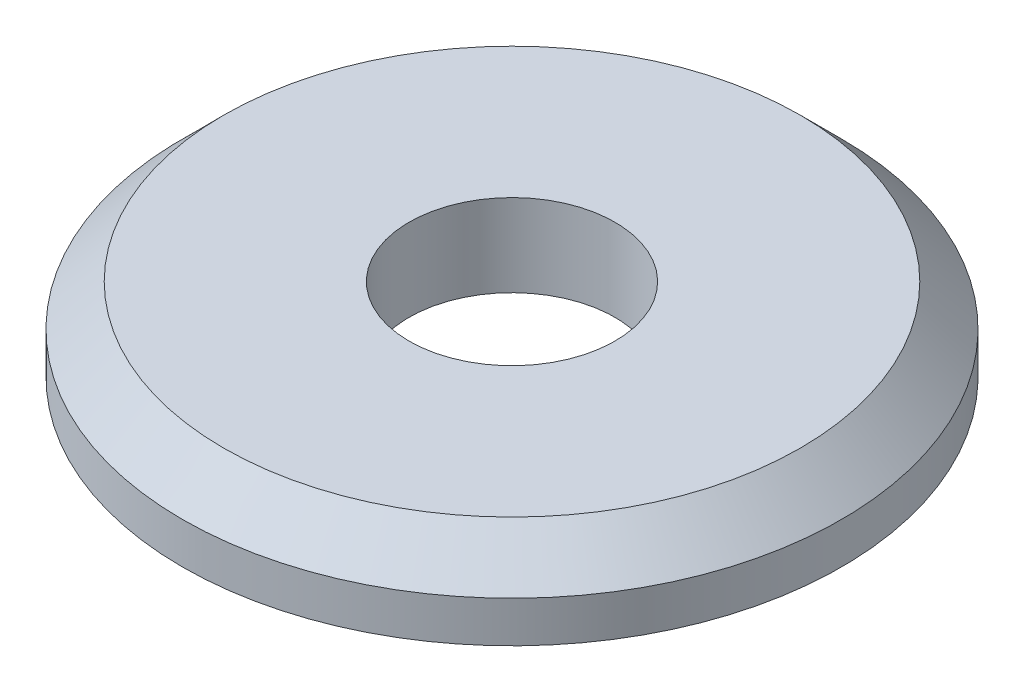
ISO-10303-21;
HEADER;
FILE_DESCRIPTION(('STEP AP214'),'2;1');
FILE_NAME('part.step','',(''),(''),'','','');
FILE_SCHEMA(('AUTOMOTIVE_DESIGN { 1 0 10303 214 1 1 1 1 }'));
ENDSEC;
DATA;
#1=APPLICATION_CONTEXT('core data for automotive mechanical design processes');
#2=APPLICATION_PROTOCOL_DEFINITION('international standard','automotive_design',2000,#1);
#3=PRODUCT_CONTEXT('',#1,'mechanical');
#4=PRODUCT('Part','Part','',(#3));
#5=PRODUCT_RELATED_PRODUCT_CATEGORY('part','',(#4));
#6=PRODUCT_DEFINITION_FORMATION('','',#4);
#7=PRODUCT_DEFINITION_CONTEXT('part definition',#1,'design');
#8=PRODUCT_DEFINITION('design','',#6,#7);
#9=PRODUCT_DEFINITION_SHAPE('','',#8);
#10=(LENGTH_UNIT() NAMED_UNIT(*) SI_UNIT(.MILLI.,.METRE.));
#11=(NAMED_UNIT(*) PLANE_ANGLE_UNIT() SI_UNIT($,.RADIAN.));
#12=(NAMED_UNIT(*) SI_UNIT($,.STERADIAN.) SOLID_ANGLE_UNIT());
#13=UNCERTAINTY_MEASURE_WITH_UNIT(LENGTH_MEASURE(1.E-05),#10,'distance_accuracy_value','');
#14=(GEOMETRIC_REPRESENTATION_CONTEXT(3) GLOBAL_UNCERTAINTY_ASSIGNED_CONTEXT((#13)) GLOBAL_UNIT_ASSIGNED_CONTEXT((#10,
#11,#12)) REPRESENTATION_CONTEXT('',''));
#15=CARTESIAN_POINT('',(0.,0.,0.));
#16=DIRECTION('',(0.,0.,1.));
#17=DIRECTION('',(1.,0.,0.));
#18=AXIS2_PLACEMENT_3D('',#15,#16,#17);
#19=CARTESIAN_POINT('',(0.,2.,0.));
#20=DIRECTION('',(0.,-1.,0.));
#21=DIRECTION('',(0.,0.,-1.));
#22=AXIS2_PLACEMENT_3D('',#19,#20,#21);
#23=CYLINDRICAL_SURFACE('',#22,8.);
#24=CARTESIAN_POINT('',(0.,0.999999999999999,0.));
#25=DIRECTION('',(0.,1.,0.));
#26=DIRECTION('',(0.,0.,1.));
#27=AXIS2_PLACEMENT_3D('',#24,#25,#26);
#28=CIRCLE('',#27,8.);
#29=CARTESIAN_POINT('',(0.,0.999999999999999,8.));
#30=VERTEX_POINT('',#29);
#31=EDGE_CURVE('E10',#30,#30,#28,.F.);
#32=ORIENTED_EDGE('',*,*,#31,.T.);
#33=EDGE_LOOP('',(#32));
#34=FACE_BOUND('',#33,.T.);
#35=CARTESIAN_POINT('',(0.,0.,0.));
#36=DIRECTION('',(0.,1.,0.));
#37=DIRECTION('',(0.,0.,1.));
#38=AXIS2_PLACEMENT_3D('',#35,#36,#37);
#39=CIRCLE('',#38,8.);
#40=CARTESIAN_POINT('',(0.,0.,8.));
#41=VERTEX_POINT('',#40);
#42=EDGE_CURVE('E44',#41,#41,#39,.T.);
#43=ORIENTED_EDGE('',*,*,#42,.T.);
#44=EDGE_LOOP('',(#43));
#45=FACE_BOUND('',#44,.T.);
#46=ADVANCED_FACE('F33',(#34,#45),#23,.T.);
#47=CARTESIAN_POINT('',(0.,2.,0.));
#48=DIRECTION('',(0.,1.,0.));
#49=DIRECTION('',(0.,0.,1.));
#50=AXIS2_PLACEMENT_3D('',#47,#48,#49);
#51=PLANE('',#50);
#52=CARTESIAN_POINT('',(0.,2.,0.));
#53=DIRECTION('',(0.,1.,0.));
#54=DIRECTION('',(0.,0.,1.));
#55=AXIS2_PLACEMENT_3D('',#52,#53,#54);
#56=CIRCLE('',#55,2.5);
#57=CARTESIAN_POINT('',(0.,2.,2.5));
#58=VERTEX_POINT('',#57);
#59=EDGE_CURVE('E51',#58,#58,#56,.T.);
#60=ORIENTED_EDGE('',*,*,#59,.F.);
#61=EDGE_LOOP('',(#60));
#62=FACE_BOUND('',#61,.T.);
#63=CARTESIAN_POINT('',(0.,2.,0.));
#64=DIRECTION('',(0.,1.,0.));
#65=DIRECTION('',(0.,0.,1.));
#66=AXIS2_PLACEMENT_3D('',#63,#64,#65);
#67=CIRCLE('',#66,7.);
#68=CARTESIAN_POINT('',(0.,2.,7.));
#69=VERTEX_POINT('',#68);
#70=EDGE_CURVE('E40',#69,#69,#67,.T.);
#71=ORIENTED_EDGE('',*,*,#70,.T.);
#72=EDGE_LOOP('',(#71));
#73=FACE_BOUND('',#72,.T.);
#74=ADVANCED_FACE('F66',(#62,#73),#51,.T.);
#75=CARTESIAN_POINT('',(0.,0.,0.));
#76=DIRECTION('',(0.,1.,0.));
#77=DIRECTION('',(0.,0.,1.));
#78=AXIS2_PLACEMENT_3D('',#75,#76,#77);
#79=PLANE('',#78);
#80=CARTESIAN_POINT('',(0.,0.,0.));
#81=DIRECTION('',(0.,1.,0.));
#82=DIRECTION('',(0.,0.,1.));
#83=AXIS2_PLACEMENT_3D('',#80,#81,#82);
#84=CIRCLE('',#83,2.5);
#85=CARTESIAN_POINT('',(0.,0.,2.5));
#86=VERTEX_POINT('',#85);
#87=EDGE_CURVE('E48',#86,#86,#84,.T.);
#88=ORIENTED_EDGE('',*,*,#87,.T.);
#89=EDGE_LOOP('',(#88));
#90=FACE_BOUND('',#89,.T.);
#91=ORIENTED_EDGE('',*,*,#42,.F.);
#92=EDGE_LOOP('',(#91));
#93=FACE_BOUND('',#92,.T.);
#94=ADVANCED_FACE('F57',(#90,#93),#79,.F.);
#95=CARTESIAN_POINT('',(0.,2.,0.));
#96=DIRECTION('',(0.,-1.,0.));
#97=DIRECTION('',(0.,0.,-1.));
#98=AXIS2_PLACEMENT_3D('',#95,#96,#97);
#99=CONICAL_SURFACE('',#98,7.,0.785398163397447);
#100=ORIENTED_EDGE('',*,*,#31,.F.);
#101=EDGE_LOOP('',(#100));
#102=FACE_BOUND('',#101,.T.);
#103=ORIENTED_EDGE('',*,*,#70,.F.);
#104=EDGE_LOOP('',(#103));
#105=FACE_BOUND('',#104,.T.);
#106=ADVANCED_FACE('F35',(#102,#105),#99,.T.);
#107=CARTESIAN_POINT('',(0.,0.,0.));
#108=DIRECTION('',(0.,1.,0.));
#109=DIRECTION('',(0.,0.,1.));
#110=AXIS2_PLACEMENT_3D('',#107,#108,#109);
#111=CYLINDRICAL_SURFACE('',#110,2.5);
#112=ORIENTED_EDGE('',*,*,#87,.F.);
#113=EDGE_LOOP('',(#112));
#114=FACE_BOUND('',#113,.T.);
#115=ORIENTED_EDGE('',*,*,#59,.T.);
#116=EDGE_LOOP('',(#115));
#117=FACE_BOUND('',#116,.T.);
#118=ADVANCED_FACE('F60',(#114,#117),#111,.F.);
#119=CLOSED_SHELL('',(#46,#74,#94,#106,#118));
#120=MANIFOLD_SOLID_BREP('B2',#119);
#121=ADVANCED_BREP_SHAPE_REPRESENTATION('',(#18,#120),#14);
#122=SHAPE_DEFINITION_REPRESENTATION(#9,#121);
ENDSEC;
END-ISO-10303-21;
